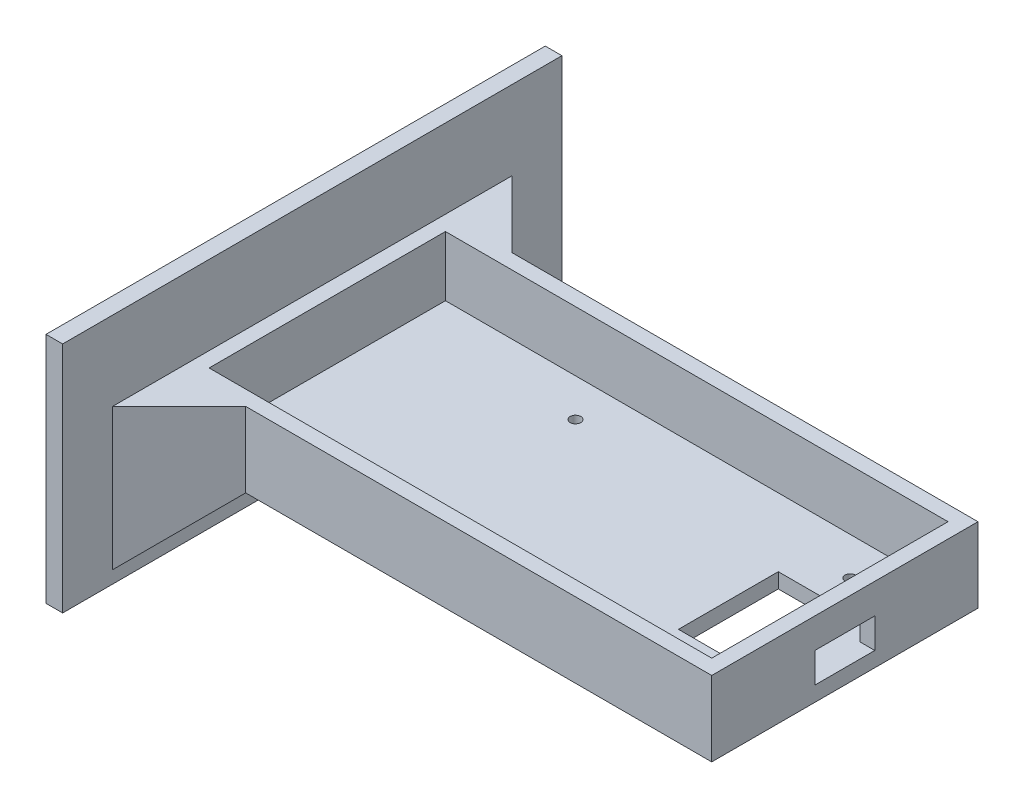
ISO-10303-21;
HEADER;
FILE_DESCRIPTION(('STEP AP214'),'2;1');
FILE_NAME('part.step','',(''),(''),'','','');
FILE_SCHEMA(('AUTOMOTIVE_DESIGN { 1 0 10303 214 1 1 1 1 }'));
ENDSEC;
DATA;
#1=APPLICATION_CONTEXT('core data for automotive mechanical design processes');
#2=APPLICATION_PROTOCOL_DEFINITION('international standard','automotive_design',2000,#1);
#3=PRODUCT_CONTEXT('',#1,'mechanical');
#4=PRODUCT('Part','Part','',(#3));
#5=PRODUCT_RELATED_PRODUCT_CATEGORY('part','',(#4));
#6=PRODUCT_DEFINITION_FORMATION('','',#4);
#7=PRODUCT_DEFINITION_CONTEXT('part definition',#1,'design');
#8=PRODUCT_DEFINITION('design','',#6,#7);
#9=PRODUCT_DEFINITION_SHAPE('','',#8);
#10=(LENGTH_UNIT() NAMED_UNIT(*) SI_UNIT(.MILLI.,.METRE.));
#11=(NAMED_UNIT(*) PLANE_ANGLE_UNIT() SI_UNIT($,.RADIAN.));
#12=(NAMED_UNIT(*) SI_UNIT($,.STERADIAN.) SOLID_ANGLE_UNIT());
#13=UNCERTAINTY_MEASURE_WITH_UNIT(LENGTH_MEASURE(1.E-05),#10,'distance_accuracy_value','');
#14=(GEOMETRIC_REPRESENTATION_CONTEXT(3) GLOBAL_UNCERTAINTY_ASSIGNED_CONTEXT((#13)) GLOBAL_UNIT_ASSIGNED_CONTEXT((#10,
#11,#12)) REPRESENTATION_CONTEXT('',''));
#15=CARTESIAN_POINT('',(0.,0.,0.));
#16=DIRECTION('',(0.,0.,1.));
#17=DIRECTION('',(1.,0.,0.));
#18=AXIS2_PLACEMENT_3D('',#15,#16,#17);
#19=CARTESIAN_POINT('',(0.,22.5,0.));
#20=DIRECTION('',(0.,1.,0.));
#21=DIRECTION('',(0.,0.,1.));
#22=AXIS2_PLACEMENT_3D('',#19,#20,#21);
#23=PLANE('',#22);
#24=DIRECTION('',(0.,0.,-1.));
#25=VECTOR('',#24,1.);
#26=CARTESIAN_POINT('',(-80.,22.5,40.));
#27=LINE('',#26,#25);
#28=CARTESIAN_POINT('',(-80.,22.5,60.0000000000002));
#29=VERTEX_POINT('',#28);
#30=CARTESIAN_POINT('',(-80.,22.5,-60.0000000000002));
#31=VERTEX_POINT('',#30);
#32=EDGE_CURVE('E349',#29,#31,#27,.T.);
#33=ORIENTED_EDGE('',*,*,#32,.F.);
#34=DIRECTION('',(0.707106781186544,0.,-0.707106781186551));
#35=VECTOR('',#34,1.);
#36=CARTESIAN_POINT('',(-60.,22.5,40.));
#37=LINE('',#36,#35);
#38=CARTESIAN_POINT('',(-60.,22.5,40.));
#39=VERTEX_POINT('',#38);
#40=EDGE_CURVE('E47',#29,#39,#37,.T.);
#41=ORIENTED_EDGE('',*,*,#40,.T.);
#42=DIRECTION('',(1.,0.,0.));
#43=VECTOR('',#42,1.);
#44=CARTESIAN_POINT('',(-80.,22.5,40.));
#45=LINE('',#44,#43);
#46=CARTESIAN_POINT('',(80.,22.5,40.));
#47=VERTEX_POINT('',#46);
#48=EDGE_CURVE('E341',#39,#47,#45,.T.);
#49=ORIENTED_EDGE('',*,*,#48,.T.);
#50=DIRECTION('',(0.,0.,-1.));
#51=VECTOR('',#50,1.);
#52=CARTESIAN_POINT('',(80.,22.5,40.));
#53=LINE('',#52,#51);
#54=CARTESIAN_POINT('',(80.,22.5,-40.));
#55=VERTEX_POINT('',#54);
#56=EDGE_CURVE('E343',#47,#55,#53,.T.);
#57=ORIENTED_EDGE('',*,*,#56,.T.);
#58=DIRECTION('',(1.,0.,0.));
#59=VECTOR('',#58,1.);
#60=CARTESIAN_POINT('',(-80.,22.5,-40.));
#61=LINE('',#60,#59);
#62=CARTESIAN_POINT('',(-60.,22.5,-40.));
#63=VERTEX_POINT('',#62);
#64=EDGE_CURVE('E347',#63,#55,#61,.T.);
#65=ORIENTED_EDGE('',*,*,#64,.F.);
#66=DIRECTION('',(0.707106781186544,0.,0.707106781186551));
#67=VECTOR('',#66,1.);
#68=CARTESIAN_POINT('',(-80.,22.5,-60.0000000000002));
#69=LINE('',#68,#67);
#70=EDGE_CURVE('E11',#63,#31,#69,.F.);
#71=ORIENTED_EDGE('',*,*,#70,.T.);
#72=EDGE_LOOP('',(#33,#41,#49,#57,#65,#71));
#73=FACE_BOUND('',#72,.T.);
#74=DIRECTION('',(1.,0.,0.));
#75=VECTOR('',#74,1.);
#76=CARTESIAN_POINT('',(-75.5,22.5,35.5));
#77=LINE('',#76,#75);
#78=CARTESIAN_POINT('',(-75.5,22.5,35.5));
#79=VERTEX_POINT('',#78);
#80=CARTESIAN_POINT('',(75.5,22.5,35.5));
#81=VERTEX_POINT('',#80);
#82=EDGE_CURVE('E310',#79,#81,#77,.T.);
#83=ORIENTED_EDGE('',*,*,#82,.F.);
#84=DIRECTION('',(0.,0.,-1.));
#85=VECTOR('',#84,1.);
#86=CARTESIAN_POINT('',(-75.5,22.5,35.5));
#87=LINE('',#86,#85);
#88=CARTESIAN_POINT('',(-75.5,22.5,-35.5));
#89=VERTEX_POINT('',#88);
#90=EDGE_CURVE('E305',#79,#89,#87,.T.);
#91=ORIENTED_EDGE('',*,*,#90,.T.);
#92=DIRECTION('',(1.,0.,0.));
#93=VECTOR('',#92,1.);
#94=CARTESIAN_POINT('',(-75.5,22.5,-35.5));
#95=LINE('',#94,#93);
#96=CARTESIAN_POINT('',(75.5,22.5,-35.5));
#97=VERTEX_POINT('',#96);
#98=EDGE_CURVE('E323',#89,#97,#95,.T.);
#99=ORIENTED_EDGE('',*,*,#98,.T.);
#100=DIRECTION('',(0.,0.,-1.));
#101=VECTOR('',#100,1.);
#102=CARTESIAN_POINT('',(75.5,22.5,35.5));
#103=LINE('',#102,#101);
#104=EDGE_CURVE('E326',#81,#97,#103,.T.);
#105=ORIENTED_EDGE('',*,*,#104,.F.);
#106=EDGE_LOOP('',(#83,#91,#99,#105));
#107=FACE_BOUND('',#106,.T.);
#108=ADVANCED_FACE('F37',(#73,#107),#23,.T.);
#109=CARTESIAN_POINT('',(-80.,22.5,40.));
#110=DIRECTION('',(0.,0.,-1.));
#111=DIRECTION('',(-1.,0.,0.));
#112=AXIS2_PLACEMENT_3D('',#109,#110,#111);
#113=PLANE('',#112);
#114=ORIENTED_EDGE('',*,*,#48,.F.);
#115=DIRECTION('',(0.,-1.,0.));
#116=VECTOR('',#115,1.);
#117=CARTESIAN_POINT('',(-60.,22.5,40.));
#118=LINE('',#117,#116);
#119=CARTESIAN_POINT('',(-60.,0.,40.));
#120=VERTEX_POINT('',#119);
#121=EDGE_CURVE('E373',#39,#120,#118,.T.);
#122=ORIENTED_EDGE('',*,*,#121,.T.);
#123=DIRECTION('',(1.,0.,0.));
#124=VECTOR('',#123,1.);
#125=CARTESIAN_POINT('',(-80.,0.,40.));
#126=LINE('',#125,#124);
#127=CARTESIAN_POINT('',(80.,0.,40.));
#128=VERTEX_POINT('',#127);
#129=EDGE_CURVE('E340',#120,#128,#126,.T.);
#130=ORIENTED_EDGE('',*,*,#129,.T.);
#131=DIRECTION('',(0.,-1.,0.));
#132=VECTOR('',#131,1.);
#133=CARTESIAN_POINT('',(80.,22.5,40.));
#134=LINE('',#133,#132);
#135=EDGE_CURVE('E359',#47,#128,#134,.T.);
#136=ORIENTED_EDGE('',*,*,#135,.F.);
#137=EDGE_LOOP('',(#114,#122,#130,#136));
#138=FACE_BOUND('',#137,.T.);
#139=ADVANCED_FACE('F448',(#138),#113,.F.);
#140=CARTESIAN_POINT('',(80.,22.5,40.));
#141=DIRECTION('',(-1.,0.,0.));
#142=DIRECTION('',(0.,0.,1.));
#143=AXIS2_PLACEMENT_3D('',#140,#141,#142);
#144=PLANE('',#143);
#145=DIRECTION('',(0.,0.,-1.));
#146=VECTOR('',#145,1.);
#147=CARTESIAN_POINT('',(80.,4.5,9.00000000000001));
#148=LINE('',#147,#146);
#149=CARTESIAN_POINT('',(80.,4.50000000000001,9.00000000000001));
#150=VERTEX_POINT('',#149);
#151=CARTESIAN_POINT('',(80.,4.5,-8.99999999999999));
#152=VERTEX_POINT('',#151);
#153=EDGE_CURVE('E251',#150,#152,#148,.T.);
#154=ORIENTED_EDGE('',*,*,#153,.F.);
#155=DIRECTION('',(0.,-1.,0.));
#156=VECTOR('',#155,1.);
#157=CARTESIAN_POINT('',(80.,13.5,9.00000000000001));
#158=LINE('',#157,#156);
#159=CARTESIAN_POINT('',(80.,13.5,9.00000000000001));
#160=VERTEX_POINT('',#159);
#161=EDGE_CURVE('E249',#160,#150,#158,.T.);
#162=ORIENTED_EDGE('',*,*,#161,.F.);
#163=DIRECTION('',(0.,0.,-1.));
#164=VECTOR('',#163,1.);
#165=CARTESIAN_POINT('',(80.,13.5,9.00000000000001));
#166=LINE('',#165,#164);
#167=CARTESIAN_POINT('',(80.,13.5,-8.99999999999999));
#168=VERTEX_POINT('',#167);
#169=EDGE_CURVE('E257',#160,#168,#166,.T.);
#170=ORIENTED_EDGE('',*,*,#169,.T.);
#171=DIRECTION('',(0.,-1.,0.));
#172=VECTOR('',#171,1.);
#173=CARTESIAN_POINT('',(80.,13.5,-8.99999999999999));
#174=LINE('',#173,#172);
#175=EDGE_CURVE('E254',#168,#152,#174,.T.);
#176=ORIENTED_EDGE('',*,*,#175,.T.);
#177=EDGE_LOOP('',(#154,#162,#170,#176));
#178=FACE_BOUND('',#177,.T.);
#179=DIRECTION('',(0.,0.,-1.));
#180=VECTOR('',#179,1.);
#181=CARTESIAN_POINT('',(80.,0.,40.));
#182=LINE('',#181,#180);
#183=CARTESIAN_POINT('',(80.,0.,-40.));
#184=VERTEX_POINT('',#183);
#185=EDGE_CURVE('E353',#128,#184,#182,.T.);
#186=ORIENTED_EDGE('',*,*,#185,.T.);
#187=DIRECTION('',(0.,-1.,0.));
#188=VECTOR('',#187,1.);
#189=CARTESIAN_POINT('',(80.,22.5,-40.));
#190=LINE('',#189,#188);
#191=EDGE_CURVE('E351',#55,#184,#190,.T.);
#192=ORIENTED_EDGE('',*,*,#191,.F.);
#193=ORIENTED_EDGE('',*,*,#56,.F.);
#194=ORIENTED_EDGE('',*,*,#135,.T.);
#195=EDGE_LOOP('',(#186,#192,#193,#194));
#196=FACE_BOUND('',#195,.T.);
#197=ADVANCED_FACE('F432',(#178,#196),#144,.F.);
#198=CARTESIAN_POINT('',(-80.,22.5,-40.));
#199=DIRECTION('',(0.,0.,-1.));
#200=DIRECTION('',(-1.,0.,0.));
#201=AXIS2_PLACEMENT_3D('',#198,#199,#200);
#202=PLANE('',#201);
#203=DIRECTION('',(1.,0.,0.));
#204=VECTOR('',#203,1.);
#205=CARTESIAN_POINT('',(-80.,0.,-40.));
#206=LINE('',#205,#204);
#207=CARTESIAN_POINT('',(-60.,0.,-40.));
#208=VERTEX_POINT('',#207);
#209=EDGE_CURVE('E344',#208,#184,#206,.T.);
#210=ORIENTED_EDGE('',*,*,#209,.F.);
#211=DIRECTION('',(0.,1.,0.));
#212=VECTOR('',#211,1.);
#213=CARTESIAN_POINT('',(-60.,22.5,-40.));
#214=LINE('',#213,#212);
#215=EDGE_CURVE('E55',#208,#63,#214,.T.);
#216=ORIENTED_EDGE('',*,*,#215,.T.);
#217=ORIENTED_EDGE('',*,*,#64,.T.);
#218=ORIENTED_EDGE('',*,*,#191,.T.);
#219=EDGE_LOOP('',(#210,#216,#217,#218));
#220=FACE_BOUND('',#219,.T.);
#221=ADVANCED_FACE('F461',(#220),#202,.T.);
#222=CARTESIAN_POINT('',(0.,0.,0.));
#223=DIRECTION('',(0.,1.,0.));
#224=DIRECTION('',(0.,0.,1.));
#225=AXIS2_PLACEMENT_3D('',#222,#223,#224);
#226=PLANE('',#225);
#227=DIRECTION('',(1.,0.,0.));
#228=VECTOR('',#227,1.);
#229=CARTESIAN_POINT('',(45.,0.,-15.));
#230=LINE('',#229,#228);
#231=CARTESIAN_POINT('',(45.,0.,-15.));
#232=VERTEX_POINT('',#231);
#233=CARTESIAN_POINT('',(70.,0.,-15.));
#234=VERTEX_POINT('',#233);
#235=EDGE_CURVE('E206',#232,#234,#230,.T.);
#236=ORIENTED_EDGE('',*,*,#235,.F.);
#237=DIRECTION('',(0.,0.,-1.));
#238=VECTOR('',#237,1.);
#239=CARTESIAN_POINT('',(45.,0.,15.));
#240=LINE('',#239,#238);
#241=CARTESIAN_POINT('',(45.,0.,15.));
#242=VERTEX_POINT('',#241);
#243=EDGE_CURVE('E211',#242,#232,#240,.T.);
#244=ORIENTED_EDGE('',*,*,#243,.F.);
#245=DIRECTION('',(-1.,0.,0.));
#246=VECTOR('',#245,1.);
#247=CARTESIAN_POINT('',(45.,0.,15.));
#248=LINE('',#247,#246);
#249=CARTESIAN_POINT('',(70.,0.,15.));
#250=VERTEX_POINT('',#249);
#251=EDGE_CURVE('E216',#250,#242,#248,.T.);
#252=ORIENTED_EDGE('',*,*,#251,.F.);
#253=DIRECTION('',(0.,0.,1.));
#254=VECTOR('',#253,1.);
#255=CARTESIAN_POINT('',(70.,0.,15.));
#256=LINE('',#255,#254);
#257=EDGE_CURVE('E195',#234,#250,#256,.T.);
#258=ORIENTED_EDGE('',*,*,#257,.F.);
#259=EDGE_LOOP('',(#236,#244,#252,#258));
#260=FACE_BOUND('',#259,.T.);
#261=CARTESIAN_POINT('',(56.23,0.,24.12));
#262=DIRECTION('',(0.,1.,0.));
#263=DIRECTION('',(0.,0.,1.));
#264=AXIS2_PLACEMENT_3D('',#261,#262,#263);
#265=CIRCLE('',#264,1.6);
#266=CARTESIAN_POINT('',(56.23,0.,25.72));
#267=VERTEX_POINT('',#266);
#268=EDGE_CURVE('E246',#267,#267,#265,.T.);
#269=ORIENTED_EDGE('',*,*,#268,.T.);
#270=EDGE_LOOP('',(#269));
#271=FACE_BOUND('',#270,.T.);
#272=CARTESIAN_POINT('',(-25.05,0.,-24.12));
#273=DIRECTION('',(0.,1.,0.));
#274=DIRECTION('',(0.,0.,1.));
#275=AXIS2_PLACEMENT_3D('',#272,#273,#274);
#276=CIRCLE('',#275,1.6);
#277=CARTESIAN_POINT('',(-25.05,0.,-22.52));
#278=VERTEX_POINT('',#277);
#279=EDGE_CURVE('E243',#278,#278,#276,.T.);
#280=ORIENTED_EDGE('',*,*,#279,.T.);
#281=EDGE_LOOP('',(#280));
#282=FACE_BOUND('',#281,.T.);
#283=CARTESIAN_POINT('',(-18.7,0.,24.14));
#284=DIRECTION('',(0.,1.,0.));
#285=DIRECTION('',(0.,0.,1.));
#286=AXIS2_PLACEMENT_3D('',#283,#284,#285);
#287=CIRCLE('',#286,1.6);
#288=CARTESIAN_POINT('',(-18.7,0.,25.74));
#289=VERTEX_POINT('',#288);
#290=EDGE_CURVE('E240',#289,#289,#287,.T.);
#291=ORIENTED_EDGE('',*,*,#290,.T.);
#292=EDGE_LOOP('',(#291));
#293=FACE_BOUND('',#292,.T.);
#294=CARTESIAN_POINT('',(57.5,0.,-24.14));
#295=DIRECTION('',(0.,1.,0.));
#296=DIRECTION('',(0.,0.,1.));
#297=AXIS2_PLACEMENT_3D('',#294,#295,#296);
#298=CIRCLE('',#297,1.6);
#299=CARTESIAN_POINT('',(57.5,0.,-22.54));
#300=VERTEX_POINT('',#299);
#301=EDGE_CURVE('E237',#300,#300,#298,.T.);
#302=ORIENTED_EDGE('',*,*,#301,.T.);
#303=EDGE_LOOP('',(#302));
#304=FACE_BOUND('',#303,.T.);
#305=ORIENTED_EDGE('',*,*,#129,.F.);
#306=DIRECTION('',(0.,0.,-1.));
#307=VECTOR('',#306,1.);
#308=CARTESIAN_POINT('',(-60.,0.,0.));
#309=LINE('',#308,#307);
#310=EDGE_CURVE('E63',#120,#208,#309,.T.);
#311=ORIENTED_EDGE('',*,*,#310,.T.);
#312=ORIENTED_EDGE('',*,*,#209,.T.);
#313=ORIENTED_EDGE('',*,*,#185,.F.);
#314=EDGE_LOOP('',(#305,#311,#312,#313));
#315=FACE_BOUND('',#314,.T.);
#316=ADVANCED_FACE('F213',(#260,#271,#282,#293,#304,#315),#226,.F.);
#317=CARTESIAN_POINT('',(-75.5,4.5,35.5));
#318=DIRECTION('',(1.,0.,0.));
#319=DIRECTION('',(0.,0.,-1.));
#320=AXIS2_PLACEMENT_3D('',#317,#318,#319);
#321=PLANE('',#320);
#322=ORIENTED_EDGE('',*,*,#90,.F.);
#323=DIRECTION('',(0.,1.,0.));
#324=VECTOR('',#323,1.);
#325=CARTESIAN_POINT('',(-75.5,4.5,35.5));
#326=LINE('',#325,#324);
#327=CARTESIAN_POINT('',(-75.5,4.5,35.5));
#328=VERTEX_POINT('',#327);
#329=EDGE_CURVE('E320',#328,#79,#326,.T.);
#330=ORIENTED_EDGE('',*,*,#329,.F.);
#331=DIRECTION('',(0.,0.,-1.));
#332=VECTOR('',#331,1.);
#333=CARTESIAN_POINT('',(-75.5,4.5,35.5));
#334=LINE('',#333,#332);
#335=CARTESIAN_POINT('',(-75.5,4.5,-35.5));
#336=VERTEX_POINT('',#335);
#337=EDGE_CURVE('E306',#328,#336,#334,.T.);
#338=ORIENTED_EDGE('',*,*,#337,.T.);
#339=DIRECTION('',(0.,1.,0.));
#340=VECTOR('',#339,1.);
#341=CARTESIAN_POINT('',(-75.5,4.5,-35.5));
#342=LINE('',#341,#340);
#343=EDGE_CURVE('E337',#336,#89,#342,.T.);
#344=ORIENTED_EDGE('',*,*,#343,.T.);
#345=EDGE_LOOP('',(#322,#330,#338,#344));
#346=FACE_BOUND('',#345,.T.);
#347=ADVANCED_FACE('F443',(#346),#321,.T.);
#348=CARTESIAN_POINT('',(-75.5,4.5,-35.5));
#349=DIRECTION('',(0.,0.,1.));
#350=DIRECTION('',(1.,0.,0.));
#351=AXIS2_PLACEMENT_3D('',#348,#349,#350);
#352=PLANE('',#351);
#353=ORIENTED_EDGE('',*,*,#98,.F.);
#354=ORIENTED_EDGE('',*,*,#343,.F.);
#355=DIRECTION('',(1.,0.,0.));
#356=VECTOR('',#355,1.);
#357=CARTESIAN_POINT('',(-75.5,4.5,-35.5));
#358=LINE('',#357,#356);
#359=CARTESIAN_POINT('',(75.5,4.5,-35.5));
#360=VERTEX_POINT('',#359);
#361=EDGE_CURVE('E309',#336,#360,#358,.T.);
#362=ORIENTED_EDGE('',*,*,#361,.T.);
#363=DIRECTION('',(0.,1.,0.));
#364=VECTOR('',#363,1.);
#365=CARTESIAN_POINT('',(75.5,4.5,-35.5));
#366=LINE('',#365,#364);
#367=EDGE_CURVE('E335',#360,#97,#366,.T.);
#368=ORIENTED_EDGE('',*,*,#367,.T.);
#369=EDGE_LOOP('',(#353,#354,#362,#368));
#370=FACE_BOUND('',#369,.T.);
#371=ADVANCED_FACE('F440',(#370),#352,.T.);
#372=CARTESIAN_POINT('',(75.5,4.5,35.5));
#373=DIRECTION('',(1.,0.,0.));
#374=DIRECTION('',(0.,0.,-1.));
#375=AXIS2_PLACEMENT_3D('',#372,#373,#374);
#376=PLANE('',#375);
#377=DIRECTION('',(0.,0.,-1.));
#378=VECTOR('',#377,1.);
#379=CARTESIAN_POINT('',(75.5,13.5,35.5));
#380=LINE('',#379,#378);
#381=CARTESIAN_POINT('',(75.5,13.5,9.00000000000001));
#382=VERTEX_POINT('',#381);
#383=CARTESIAN_POINT('',(75.5,13.5,-8.99999999999999));
#384=VERTEX_POINT('',#383);
#385=EDGE_CURVE('E362',#382,#384,#380,.T.);
#386=ORIENTED_EDGE('',*,*,#385,.F.);
#387=DIRECTION('',(0.,-1.,0.));
#388=VECTOR('',#387,1.);
#389=CARTESIAN_POINT('',(75.5,4.50000000000001,9.00000000000001));
#390=LINE('',#389,#388);
#391=CARTESIAN_POINT('',(75.5,4.5,9.00000000000001));
#392=VERTEX_POINT('',#391);
#393=EDGE_CURVE('E272',#382,#392,#390,.T.);
#394=ORIENTED_EDGE('',*,*,#393,.T.);
#395=DIRECTION('',(0.,0.,-1.));
#396=VECTOR('',#395,1.);
#397=CARTESIAN_POINT('',(75.5,4.5,35.5));
#398=LINE('',#397,#396);
#399=CARTESIAN_POINT('',(75.5,4.5,35.5));
#400=VERTEX_POINT('',#399);
#401=EDGE_CURVE('E314',#400,#392,#398,.T.);
#402=ORIENTED_EDGE('',*,*,#401,.F.);
#403=DIRECTION('',(0.,1.,0.));
#404=VECTOR('',#403,1.);
#405=CARTESIAN_POINT('',(75.5,4.5,35.5));
#406=LINE('',#405,#404);
#407=EDGE_CURVE('E333',#400,#81,#406,.T.);
#408=ORIENTED_EDGE('',*,*,#407,.T.);
#409=ORIENTED_EDGE('',*,*,#104,.T.);
#410=ORIENTED_EDGE('',*,*,#367,.F.);
#411=CARTESIAN_POINT('',(75.5,4.5,-8.99999999999999));
#412=VERTEX_POINT('',#411);
#413=EDGE_CURVE('E313',#412,#360,#398,.T.);
#414=ORIENTED_EDGE('',*,*,#413,.F.);
#415=DIRECTION('',(0.,-1.,0.));
#416=VECTOR('',#415,1.);
#417=CARTESIAN_POINT('',(75.5,4.50000000000001,-8.99999999999999));
#418=LINE('',#417,#416);
#419=EDGE_CURVE('E263',#384,#412,#418,.T.);
#420=ORIENTED_EDGE('',*,*,#419,.F.);
#421=EDGE_LOOP('',(#386,#394,#402,#408,#409,#410,#414,#420));
#422=FACE_BOUND('',#421,.T.);
#423=ADVANCED_FACE('F420',(#422),#376,.F.);
#424=CARTESIAN_POINT('',(-75.5,4.5,35.5));
#425=DIRECTION('',(0.,0.,1.));
#426=DIRECTION('',(1.,0.,0.));
#427=AXIS2_PLACEMENT_3D('',#424,#425,#426);
#428=PLANE('',#427);
#429=ORIENTED_EDGE('',*,*,#82,.T.);
#430=ORIENTED_EDGE('',*,*,#407,.F.);
#431=DIRECTION('',(1.,0.,0.));
#432=VECTOR('',#431,1.);
#433=CARTESIAN_POINT('',(-75.5,4.5,35.5));
#434=LINE('',#433,#432);
#435=EDGE_CURVE('E317',#328,#400,#434,.T.);
#436=ORIENTED_EDGE('',*,*,#435,.F.);
#437=ORIENTED_EDGE('',*,*,#329,.T.);
#438=EDGE_LOOP('',(#429,#430,#436,#437));
#439=FACE_BOUND('',#438,.T.);
#440=ADVANCED_FACE('F404',(#439),#428,.F.);
#441=CARTESIAN_POINT('',(0.,4.5,0.));
#442=DIRECTION('',(0.,-1.,0.));
#443=DIRECTION('',(0.,0.,-1.));
#444=AXIS2_PLACEMENT_3D('',#441,#442,#443);
#445=PLANE('',#444);
#446=DIRECTION('',(-1.,0.,0.));
#447=VECTOR('',#446,1.);
#448=CARTESIAN_POINT('',(0.,4.5,15.));
#449=LINE('',#448,#447);
#450=CARTESIAN_POINT('',(70.,4.5,15.));
#451=VERTEX_POINT('',#450);
#452=CARTESIAN_POINT('',(45.,4.5,15.));
#453=VERTEX_POINT('',#452);
#454=EDGE_CURVE('E367',#451,#453,#449,.T.);
#455=ORIENTED_EDGE('',*,*,#454,.T.);
#456=DIRECTION('',(0.,0.,-1.));
#457=VECTOR('',#456,1.);
#458=CARTESIAN_POINT('',(45.,4.5,0.));
#459=LINE('',#458,#457);
#460=CARTESIAN_POINT('',(45.,4.5,-15.));
#461=VERTEX_POINT('',#460);
#462=EDGE_CURVE('E370',#453,#461,#459,.T.);
#463=ORIENTED_EDGE('',*,*,#462,.T.);
#464=DIRECTION('',(1.,0.,0.));
#465=VECTOR('',#464,1.);
#466=CARTESIAN_POINT('',(0.,4.5,-15.));
#467=LINE('',#466,#465);
#468=CARTESIAN_POINT('',(70.,4.5,-15.));
#469=VERTEX_POINT('',#468);
#470=EDGE_CURVE('E364',#461,#469,#467,.T.);
#471=ORIENTED_EDGE('',*,*,#470,.T.);
#472=DIRECTION('',(0.,0.,1.));
#473=VECTOR('',#472,1.);
#474=CARTESIAN_POINT('',(70.,4.5,0.));
#475=LINE('',#474,#473);
#476=EDGE_CURVE('E198',#469,#451,#475,.T.);
#477=ORIENTED_EDGE('',*,*,#476,.T.);
#478=EDGE_LOOP('',(#455,#463,#471,#477));
#479=FACE_BOUND('',#478,.T.);
#480=CARTESIAN_POINT('',(56.23,4.5,24.12));
#481=DIRECTION('',(0.,1.,0.));
#482=DIRECTION('',(0.,0.,1.));
#483=AXIS2_PLACEMENT_3D('',#480,#481,#482);
#484=CIRCLE('',#483,1.6);
#485=CARTESIAN_POINT('',(56.23,4.5,25.72));
#486=VERTEX_POINT('',#485);
#487=EDGE_CURVE('E229',#486,#486,#484,.T.);
#488=ORIENTED_EDGE('',*,*,#487,.F.);
#489=EDGE_LOOP('',(#488));
#490=FACE_BOUND('',#489,.T.);
#491=CARTESIAN_POINT('',(-25.05,4.5,-24.12));
#492=DIRECTION('',(0.,1.,0.));
#493=DIRECTION('',(0.,0.,1.));
#494=AXIS2_PLACEMENT_3D('',#491,#492,#493);
#495=CIRCLE('',#494,1.6);
#496=CARTESIAN_POINT('',(-25.05,4.5,-22.52));
#497=VERTEX_POINT('',#496);
#498=EDGE_CURVE('E228',#497,#497,#495,.T.);
#499=ORIENTED_EDGE('',*,*,#498,.F.);
#500=EDGE_LOOP('',(#499));
#501=FACE_BOUND('',#500,.T.);
#502=CARTESIAN_POINT('',(-18.7,4.5,24.14));
#503=DIRECTION('',(0.,1.,0.));
#504=DIRECTION('',(0.,0.,1.));
#505=AXIS2_PLACEMENT_3D('',#502,#503,#504);
#506=CIRCLE('',#505,1.6);
#507=CARTESIAN_POINT('',(-18.7,4.5,25.74));
#508=VERTEX_POINT('',#507);
#509=EDGE_CURVE('E223',#508,#508,#506,.T.);
#510=ORIENTED_EDGE('',*,*,#509,.F.);
#511=EDGE_LOOP('',(#510));
#512=FACE_BOUND('',#511,.T.);
#513=CARTESIAN_POINT('',(57.5,4.5,-24.14));
#514=DIRECTION('',(0.,1.,0.));
#515=DIRECTION('',(0.,0.,1.));
#516=AXIS2_PLACEMENT_3D('',#513,#514,#515);
#517=CIRCLE('',#516,1.6);
#518=CARTESIAN_POINT('',(57.5,4.5,-22.54));
#519=VERTEX_POINT('',#518);
#520=EDGE_CURVE('E232',#519,#519,#517,.T.);
#521=ORIENTED_EDGE('',*,*,#520,.F.);
#522=EDGE_LOOP('',(#521));
#523=FACE_BOUND('',#522,.T.);
#524=ORIENTED_EDGE('',*,*,#401,.T.);
#525=DIRECTION('',(1.,0.,0.));
#526=VECTOR('',#525,1.);
#527=CARTESIAN_POINT('',(67.,4.5,9.00000000000001));
#528=LINE('',#527,#526);
#529=EDGE_CURVE('E260',#392,#150,#528,.T.);
#530=ORIENTED_EDGE('',*,*,#529,.T.);
#531=ORIENTED_EDGE('',*,*,#153,.T.);
#532=DIRECTION('',(1.,0.,0.));
#533=VECTOR('',#532,1.);
#534=CARTESIAN_POINT('',(67.,4.5,-8.99999999999999));
#535=LINE('',#534,#533);
#536=EDGE_CURVE('E266',#412,#152,#535,.T.);
#537=ORIENTED_EDGE('',*,*,#536,.F.);
#538=ORIENTED_EDGE('',*,*,#413,.T.);
#539=ORIENTED_EDGE('',*,*,#361,.F.);
#540=ORIENTED_EDGE('',*,*,#337,.F.);
#541=ORIENTED_EDGE('',*,*,#435,.T.);
#542=EDGE_LOOP('',(#524,#530,#531,#537,#538,#539,#540,#541));
#543=FACE_BOUND('',#542,.T.);
#544=ADVANCED_FACE('F400',(#479,#490,#501,#512,#523,#543),#445,.F.);
#545=CARTESIAN_POINT('',(-80.,0.,0.));
#546=DIRECTION('',(1.,0.,0.));
#547=DIRECTION('',(0.,0.,-1.));
#548=AXIS2_PLACEMENT_3D('',#545,#546,#547);
#549=PLANE('',#548);
#550=DIRECTION('',(0.,1.,0.));
#551=VECTOR('',#550,1.);
#552=CARTESIAN_POINT('',(-80.,-23.75,75.));
#553=LINE('',#552,#551);
#554=CARTESIAN_POINT('',(-80.,-23.75,75.));
#555=VERTEX_POINT('',#554);
#556=CARTESIAN_POINT('',(-80.,46.25,75.));
#557=VERTEX_POINT('',#556);
#558=EDGE_CURVE('E275',#555,#557,#553,.T.);
#559=ORIENTED_EDGE('',*,*,#558,.F.);
#560=DIRECTION('',(0.,0.,1.));
#561=VECTOR('',#560,1.);
#562=CARTESIAN_POINT('',(-80.,-23.75,-75.));
#563=LINE('',#562,#561);
#564=CARTESIAN_POINT('',(-80.,-23.75,-75.));
#565=VERTEX_POINT('',#564);
#566=EDGE_CURVE('E280',#565,#555,#563,.T.);
#567=ORIENTED_EDGE('',*,*,#566,.F.);
#568=DIRECTION('',(0.,-1.,0.));
#569=VECTOR('',#568,1.);
#570=CARTESIAN_POINT('',(-80.,-23.75,-75.));
#571=LINE('',#570,#569);
#572=CARTESIAN_POINT('',(-80.,46.25,-75.));
#573=VERTEX_POINT('',#572);
#574=EDGE_CURVE('E291',#573,#565,#571,.T.);
#575=ORIENTED_EDGE('',*,*,#574,.F.);
#576=DIRECTION('',(0.,0.,-1.));
#577=VECTOR('',#576,1.);
#578=CARTESIAN_POINT('',(-80.,46.25,-75.));
#579=LINE('',#578,#577);
#580=EDGE_CURVE('E289',#557,#573,#579,.T.);
#581=ORIENTED_EDGE('',*,*,#580,.F.);
#582=EDGE_LOOP('',(#559,#567,#575,#581));
#583=FACE_BOUND('',#582,.T.);
#584=DIRECTION('',(0.,1.,0.));
#585=VECTOR('',#584,1.);
#586=CARTESIAN_POINT('',(-80.,0.,60.0000000000002));
#587=LINE('',#586,#585);
#588=CARTESIAN_POINT('',(-80.,-20.0000000000002,60.0000000000002));
#589=VERTEX_POINT('',#588);
#590=EDGE_CURVE('E380',#589,#29,#587,.T.);
#591=ORIENTED_EDGE('',*,*,#590,.T.);
#592=ORIENTED_EDGE('',*,*,#32,.T.);
#593=DIRECTION('',(0.,-1.,0.));
#594=VECTOR('',#593,1.);
#595=CARTESIAN_POINT('',(-80.,0.,-60.0000000000002));
#596=LINE('',#595,#594);
#597=CARTESIAN_POINT('',(-80.,-20.0000000000002,-60.0000000000002));
#598=VERTEX_POINT('',#597);
#599=EDGE_CURVE('E376',#31,#598,#596,.T.);
#600=ORIENTED_EDGE('',*,*,#599,.T.);
#601=DIRECTION('',(0.,0.,1.));
#602=VECTOR('',#601,1.);
#603=CARTESIAN_POINT('',(-80.,-20.0000000000002,0.));
#604=LINE('',#603,#602);
#605=EDGE_CURVE('E378',#598,#589,#604,.T.);
#606=ORIENTED_EDGE('',*,*,#605,.T.);
#607=EDGE_LOOP('',(#591,#592,#600,#606));
#608=FACE_BOUND('',#607,.T.);
#609=ADVANCED_FACE('F403',(#583,#608),#549,.T.);
#610=CARTESIAN_POINT('',(-85.,-23.75,75.));
#611=DIRECTION('',(0.,0.,-1.));
#612=DIRECTION('',(-1.,0.,0.));
#613=AXIS2_PLACEMENT_3D('',#610,#611,#612);
#614=PLANE('',#613);
#615=ORIENTED_EDGE('',*,*,#558,.T.);
#616=DIRECTION('',(1.,0.,0.));
#617=VECTOR('',#616,1.);
#618=CARTESIAN_POINT('',(-85.,46.25,75.));
#619=LINE('',#618,#617);
#620=CARTESIAN_POINT('',(-85.,46.25,75.));
#621=VERTEX_POINT('',#620);
#622=EDGE_CURVE('E302',#621,#557,#619,.T.);
#623=ORIENTED_EDGE('',*,*,#622,.F.);
#624=DIRECTION('',(0.,1.,0.));
#625=VECTOR('',#624,1.);
#626=CARTESIAN_POINT('',(-85.,-23.75,75.));
#627=LINE('',#626,#625);
#628=CARTESIAN_POINT('',(-85.,-23.75,75.));
#629=VERTEX_POINT('',#628);
#630=EDGE_CURVE('E276',#629,#621,#627,.T.);
#631=ORIENTED_EDGE('',*,*,#630,.F.);
#632=DIRECTION('',(1.,0.,0.));
#633=VECTOR('',#632,1.);
#634=CARTESIAN_POINT('',(-85.,-23.75,75.));
#635=LINE('',#634,#633);
#636=EDGE_CURVE('E286',#629,#555,#635,.T.);
#637=ORIENTED_EDGE('',*,*,#636,.T.);
#638=EDGE_LOOP('',(#615,#623,#631,#637));
#639=FACE_BOUND('',#638,.T.);
#640=ADVANCED_FACE('F494',(#639),#614,.F.);
#641=CARTESIAN_POINT('',(-85.,46.25,-75.));
#642=DIRECTION('',(0.,-1.,0.));
#643=DIRECTION('',(0.,0.,-1.));
#644=AXIS2_PLACEMENT_3D('',#641,#642,#643);
#645=PLANE('',#644);
#646=ORIENTED_EDGE('',*,*,#580,.T.);
#647=DIRECTION('',(1.,0.,0.));
#648=VECTOR('',#647,1.);
#649=CARTESIAN_POINT('',(-85.,46.25,-75.));
#650=LINE('',#649,#648);
#651=CARTESIAN_POINT('',(-85.,46.25,-75.));
#652=VERTEX_POINT('',#651);
#653=EDGE_CURVE('E299',#652,#573,#650,.T.);
#654=ORIENTED_EDGE('',*,*,#653,.F.);
#655=DIRECTION('',(0.,0.,-1.));
#656=VECTOR('',#655,1.);
#657=CARTESIAN_POINT('',(-85.,46.25,-75.));
#658=LINE('',#657,#656);
#659=EDGE_CURVE('E279',#621,#652,#658,.T.);
#660=ORIENTED_EDGE('',*,*,#659,.F.);
#661=ORIENTED_EDGE('',*,*,#622,.T.);
#662=EDGE_LOOP('',(#646,#654,#660,#661));
#663=FACE_BOUND('',#662,.T.);
#664=ADVANCED_FACE('F500',(#663),#645,.F.);
#665=CARTESIAN_POINT('',(-85.,-23.75,-75.));
#666=DIRECTION('',(0.,0.,1.));
#667=DIRECTION('',(1.,0.,0.));
#668=AXIS2_PLACEMENT_3D('',#665,#666,#667);
#669=PLANE('',#668);
#670=ORIENTED_EDGE('',*,*,#574,.T.);
#671=DIRECTION('',(1.,0.,0.));
#672=VECTOR('',#671,1.);
#673=CARTESIAN_POINT('',(-85.,-23.75,-75.));
#674=LINE('',#673,#672);
#675=CARTESIAN_POINT('',(-85.,-23.75,-75.));
#676=VERTEX_POINT('',#675);
#677=EDGE_CURVE('E296',#676,#565,#674,.T.);
#678=ORIENTED_EDGE('',*,*,#677,.F.);
#679=DIRECTION('',(0.,-1.,0.));
#680=VECTOR('',#679,1.);
#681=CARTESIAN_POINT('',(-85.,-23.75,-75.));
#682=LINE('',#681,#680);
#683=EDGE_CURVE('E282',#652,#676,#682,.T.);
#684=ORIENTED_EDGE('',*,*,#683,.F.);
#685=ORIENTED_EDGE('',*,*,#653,.T.);
#686=EDGE_LOOP('',(#670,#678,#684,#685));
#687=FACE_BOUND('',#686,.T.);
#688=ADVANCED_FACE('F511',(#687),#669,.F.);
#689=CARTESIAN_POINT('',(-85.,-23.75,-75.));
#690=DIRECTION('',(0.,1.,0.));
#691=DIRECTION('',(0.,0.,1.));
#692=AXIS2_PLACEMENT_3D('',#689,#690,#691);
#693=PLANE('',#692);
#694=ORIENTED_EDGE('',*,*,#566,.T.);
#695=ORIENTED_EDGE('',*,*,#636,.F.);
#696=DIRECTION('',(0.,0.,1.));
#697=VECTOR('',#696,1.);
#698=CARTESIAN_POINT('',(-85.,-23.75,-75.));
#699=LINE('',#698,#697);
#700=EDGE_CURVE('E284',#676,#629,#699,.T.);
#701=ORIENTED_EDGE('',*,*,#700,.F.);
#702=ORIENTED_EDGE('',*,*,#677,.T.);
#703=EDGE_LOOP('',(#694,#695,#701,#702));
#704=FACE_BOUND('',#703,.T.);
#705=ADVANCED_FACE('F508',(#704),#693,.F.);
#706=CARTESIAN_POINT('',(-85.,0.,0.));
#707=DIRECTION('',(1.,0.,0.));
#708=DIRECTION('',(0.,0.,-1.));
#709=AXIS2_PLACEMENT_3D('',#706,#707,#708);
#710=PLANE('',#709);
#711=ORIENTED_EDGE('',*,*,#630,.T.);
#712=ORIENTED_EDGE('',*,*,#659,.T.);
#713=ORIENTED_EDGE('',*,*,#683,.T.);
#714=ORIENTED_EDGE('',*,*,#700,.T.);
#715=EDGE_LOOP('',(#711,#712,#713,#714));
#716=FACE_BOUND('',#715,.T.);
#717=ADVANCED_FACE('F506',(#716),#710,.F.);
#718=CARTESIAN_POINT('',(67.,13.5,9.00000000000001));
#719=DIRECTION('',(0.,-1.,0.));
#720=DIRECTION('',(0.,0.,-1.));
#721=AXIS2_PLACEMENT_3D('',#718,#719,#720);
#722=PLANE('',#721);
#723=ORIENTED_EDGE('',*,*,#385,.T.);
#724=DIRECTION('',(1.,0.,0.));
#725=VECTOR('',#724,1.);
#726=CARTESIAN_POINT('',(67.,13.5,-8.99999999999999));
#727=LINE('',#726,#725);
#728=EDGE_CURVE('E264',#384,#168,#727,.T.);
#729=ORIENTED_EDGE('',*,*,#728,.T.);
#730=ORIENTED_EDGE('',*,*,#169,.F.);
#731=DIRECTION('',(1.,0.,0.));
#732=VECTOR('',#731,1.);
#733=CARTESIAN_POINT('',(67.,13.5,9.00000000000001));
#734=LINE('',#733,#732);
#735=EDGE_CURVE('E261',#382,#160,#734,.T.);
#736=ORIENTED_EDGE('',*,*,#735,.F.);
#737=EDGE_LOOP('',(#723,#729,#730,#736));
#738=FACE_BOUND('',#737,.T.);
#739=ADVANCED_FACE('F427',(#738),#722,.T.);
#740=CARTESIAN_POINT('',(67.,13.5,9.00000000000001));
#741=DIRECTION('',(0.,0.,1.));
#742=DIRECTION('',(0.,-1.,0.));
#743=AXIS2_PLACEMENT_3D('',#740,#741,#742);
#744=PLANE('',#743);
#745=ORIENTED_EDGE('',*,*,#735,.T.);
#746=ORIENTED_EDGE('',*,*,#161,.T.);
#747=ORIENTED_EDGE('',*,*,#529,.F.);
#748=ORIENTED_EDGE('',*,*,#393,.F.);
#749=EDGE_LOOP('',(#745,#746,#747,#748));
#750=FACE_BOUND('',#749,.T.);
#751=ADVANCED_FACE('F424',(#750),#744,.F.);
#752=CARTESIAN_POINT('',(67.,13.5,-8.99999999999999));
#753=DIRECTION('',(0.,0.,1.));
#754=DIRECTION('',(0.,-1.,0.));
#755=AXIS2_PLACEMENT_3D('',#752,#753,#754);
#756=PLANE('',#755);
#757=ORIENTED_EDGE('',*,*,#419,.T.);
#758=ORIENTED_EDGE('',*,*,#536,.T.);
#759=ORIENTED_EDGE('',*,*,#175,.F.);
#760=ORIENTED_EDGE('',*,*,#728,.F.);
#761=EDGE_LOOP('',(#757,#758,#759,#760));
#762=FACE_BOUND('',#761,.T.);
#763=ADVANCED_FACE('F436',(#762),#756,.T.);
#764=CARTESIAN_POINT('',(57.5,-8.5,-24.14));
#765=DIRECTION('',(0.,1.,0.));
#766=DIRECTION('',(0.,0.,1.));
#767=AXIS2_PLACEMENT_3D('',#764,#765,#766);
#768=CYLINDRICAL_SURFACE('',#767,1.6);
#769=ORIENTED_EDGE('',*,*,#520,.T.);
#770=EDGE_LOOP('',(#769));
#771=FACE_BOUND('',#770,.T.);
#772=ORIENTED_EDGE('',*,*,#301,.F.);
#773=EDGE_LOOP('',(#772));
#774=FACE_BOUND('',#773,.T.);
#775=ADVANCED_FACE('F620',(#771,#774),#768,.F.);
#776=CARTESIAN_POINT('',(-18.7,-8.5,24.14));
#777=DIRECTION('',(0.,1.,0.));
#778=DIRECTION('',(0.,0.,1.));
#779=AXIS2_PLACEMENT_3D('',#776,#777,#778);
#780=CYLINDRICAL_SURFACE('',#779,1.6);
#781=ORIENTED_EDGE('',*,*,#509,.T.);
#782=EDGE_LOOP('',(#781));
#783=FACE_BOUND('',#782,.T.);
#784=ORIENTED_EDGE('',*,*,#290,.F.);
#785=EDGE_LOOP('',(#784));
#786=FACE_BOUND('',#785,.T.);
#787=ADVANCED_FACE('F610',(#783,#786),#780,.F.);
#788=CARTESIAN_POINT('',(-25.05,-8.5,-24.12));
#789=DIRECTION('',(0.,1.,0.));
#790=DIRECTION('',(0.,0.,1.));
#791=AXIS2_PLACEMENT_3D('',#788,#789,#790);
#792=CYLINDRICAL_SURFACE('',#791,1.6);
#793=ORIENTED_EDGE('',*,*,#498,.T.);
#794=EDGE_LOOP('',(#793));
#795=FACE_BOUND('',#794,.T.);
#796=ORIENTED_EDGE('',*,*,#279,.F.);
#797=EDGE_LOOP('',(#796));
#798=FACE_BOUND('',#797,.T.);
#799=ADVANCED_FACE('F600',(#795,#798),#792,.F.);
#800=CARTESIAN_POINT('',(56.23,-8.5,24.12));
#801=DIRECTION('',(0.,1.,0.));
#802=DIRECTION('',(0.,0.,1.));
#803=AXIS2_PLACEMENT_3D('',#800,#801,#802);
#804=CYLINDRICAL_SURFACE('',#803,1.6);
#805=ORIENTED_EDGE('',*,*,#487,.T.);
#806=EDGE_LOOP('',(#805));
#807=FACE_BOUND('',#806,.T.);
#808=ORIENTED_EDGE('',*,*,#268,.F.);
#809=EDGE_LOOP('',(#808));
#810=FACE_BOUND('',#809,.T.);
#811=ADVANCED_FACE('F582',(#807,#810),#804,.F.);
#812=CARTESIAN_POINT('',(45.,13.,15.));
#813=DIRECTION('',(-1.,0.,0.));
#814=DIRECTION('',(0.,0.,1.));
#815=AXIS2_PLACEMENT_3D('',#812,#813,#814);
#816=PLANE('',#815);
#817=DIRECTION('',(0.,-1.,0.));
#818=VECTOR('',#817,1.);
#819=CARTESIAN_POINT('',(45.,13.,15.));
#820=LINE('',#819,#818);
#821=EDGE_CURVE('E221',#453,#242,#820,.T.);
#822=ORIENTED_EDGE('',*,*,#821,.T.);
#823=ORIENTED_EDGE('',*,*,#243,.T.);
#824=DIRECTION('',(0.,-1.,0.));
#825=VECTOR('',#824,1.);
#826=CARTESIAN_POINT('',(45.,13.,-15.));
#827=LINE('',#826,#825);
#828=EDGE_CURVE('E202',#461,#232,#827,.T.);
#829=ORIENTED_EDGE('',*,*,#828,.F.);
#830=ORIENTED_EDGE('',*,*,#462,.F.);
#831=EDGE_LOOP('',(#822,#823,#829,#830));
#832=FACE_BOUND('',#831,.T.);
#833=ADVANCED_FACE('F395',(#832),#816,.F.);
#834=CARTESIAN_POINT('',(45.,13.,15.));
#835=DIRECTION('',(0.,0.,1.));
#836=DIRECTION('',(1.,0.,0.));
#837=AXIS2_PLACEMENT_3D('',#834,#835,#836);
#838=PLANE('',#837);
#839=DIRECTION('',(0.,-1.,0.));
#840=VECTOR('',#839,1.);
#841=CARTESIAN_POINT('',(70.,13.,15.));
#842=LINE('',#841,#840);
#843=EDGE_CURVE('E201',#451,#250,#842,.T.);
#844=ORIENTED_EDGE('',*,*,#843,.T.);
#845=ORIENTED_EDGE('',*,*,#251,.T.);
#846=ORIENTED_EDGE('',*,*,#821,.F.);
#847=ORIENTED_EDGE('',*,*,#454,.F.);
#848=EDGE_LOOP('',(#844,#845,#846,#847));
#849=FACE_BOUND('',#848,.T.);
#850=ADVANCED_FACE('F398',(#849),#838,.F.);
#851=CARTESIAN_POINT('',(70.,13.,15.));
#852=DIRECTION('',(1.,0.,0.));
#853=DIRECTION('',(0.,0.,-1.));
#854=AXIS2_PLACEMENT_3D('',#851,#852,#853);
#855=PLANE('',#854);
#856=DIRECTION('',(0.,-1.,0.));
#857=VECTOR('',#856,1.);
#858=CARTESIAN_POINT('',(70.,13.,-15.));
#859=LINE('',#858,#857);
#860=EDGE_CURVE('E190',#469,#234,#859,.T.);
#861=ORIENTED_EDGE('',*,*,#860,.T.);
#862=ORIENTED_EDGE('',*,*,#257,.T.);
#863=ORIENTED_EDGE('',*,*,#843,.F.);
#864=ORIENTED_EDGE('',*,*,#476,.F.);
#865=EDGE_LOOP('',(#861,#862,#863,#864));
#866=FACE_BOUND('',#865,.T.);
#867=ADVANCED_FACE('F192',(#866),#855,.F.);
#868=CARTESIAN_POINT('',(45.,13.,-15.));
#869=DIRECTION('',(0.,0.,-1.));
#870=DIRECTION('',(-1.,0.,0.));
#871=AXIS2_PLACEMENT_3D('',#868,#869,#870);
#872=PLANE('',#871);
#873=ORIENTED_EDGE('',*,*,#828,.T.);
#874=ORIENTED_EDGE('',*,*,#235,.T.);
#875=ORIENTED_EDGE('',*,*,#860,.F.);
#876=ORIENTED_EDGE('',*,*,#470,.F.);
#877=EDGE_LOOP('',(#873,#874,#875,#876));
#878=FACE_BOUND('',#877,.T.);
#879=ADVANCED_FACE('F207',(#878),#872,.F.);
#880=CARTESIAN_POINT('',(-80.,0.,-60.0000000000002));
#881=DIRECTION('',(0.707106781186551,0.,-0.707106781186544));
#882=DIRECTION('',(0.,1.,0.));
#883=AXIS2_PLACEMENT_3D('',#880,#881,#882);
#884=PLANE('',#883);
#885=ORIENTED_EDGE('',*,*,#70,.F.);
#886=ORIENTED_EDGE('',*,*,#215,.F.);
#887=DIRECTION('',(0.577350269189622,0.577350269189628,0.577350269189628));
#888=VECTOR('',#887,1.);
#889=CARTESIAN_POINT('',(-73.3333333333333,-13.3333333333334,-53.3333333333334));
#890=LINE('',#889,#888);
#891=EDGE_CURVE('E42',#598,#208,#890,.T.);
#892=ORIENTED_EDGE('',*,*,#891,.F.);
#893=ORIENTED_EDGE('',*,*,#599,.F.);
#894=EDGE_LOOP('',(#885,#886,#892,#893));
#895=FACE_BOUND('',#894,.T.);
#896=ADVANCED_FACE('F40',(#895),#884,.T.);
#897=CARTESIAN_POINT('',(-60.,0.,0.));
#898=DIRECTION('',(-0.707106781186551,0.707106781186543,0.));
#899=DIRECTION('',(0.,0.,-1.));
#900=AXIS2_PLACEMENT_3D('',#897,#898,#899);
#901=PLANE('',#900);
#902=ORIENTED_EDGE('',*,*,#891,.T.);
#903=ORIENTED_EDGE('',*,*,#310,.F.);
#904=DIRECTION('',(-0.577350269189622,-0.577350269189628,0.577350269189628));
#905=VECTOR('',#904,1.);
#906=CARTESIAN_POINT('',(-46.6666666666667,13.3333333333334,26.6666666666666));
#907=LINE('',#906,#905);
#908=EDGE_CURVE('E385',#589,#120,#907,.F.);
#909=ORIENTED_EDGE('',*,*,#908,.F.);
#910=ORIENTED_EDGE('',*,*,#605,.F.);
#911=EDGE_LOOP('',(#902,#903,#909,#910));
#912=FACE_BOUND('',#911,.T.);
#913=ADVANCED_FACE('F472',(#912),#901,.F.);
#914=CARTESIAN_POINT('',(-60.,22.5,40.));
#915=DIRECTION('',(-0.707106781186551,0.,-0.707106781186544));
#916=DIRECTION('',(0.,-1.,0.));
#917=AXIS2_PLACEMENT_3D('',#914,#915,#916);
#918=PLANE('',#917);
#919=ORIENTED_EDGE('',*,*,#40,.F.);
#920=ORIENTED_EDGE('',*,*,#590,.F.);
#921=ORIENTED_EDGE('',*,*,#908,.T.);
#922=ORIENTED_EDGE('',*,*,#121,.F.);
#923=EDGE_LOOP('',(#919,#920,#921,#922));
#924=FACE_BOUND('',#923,.T.);
#925=ADVANCED_FACE('F467',(#924),#918,.F.);
#926=CLOSED_SHELL('',(#108,#139,#197,#221,#316,#347,#371,#423,#440,#544,#609,#640,#664,#688,
#705,#717,#739,#751,#763,#775,#787,#799,#811,#833,#850,#867,#879,#896,#913,#925));
#927=MANIFOLD_SOLID_BREP('B2',#926);
#928=ADVANCED_BREP_SHAPE_REPRESENTATION('',(#18,#927),#14);
#929=SHAPE_DEFINITION_REPRESENTATION(#9,#928);
ENDSEC;
END-ISO-10303-21;
